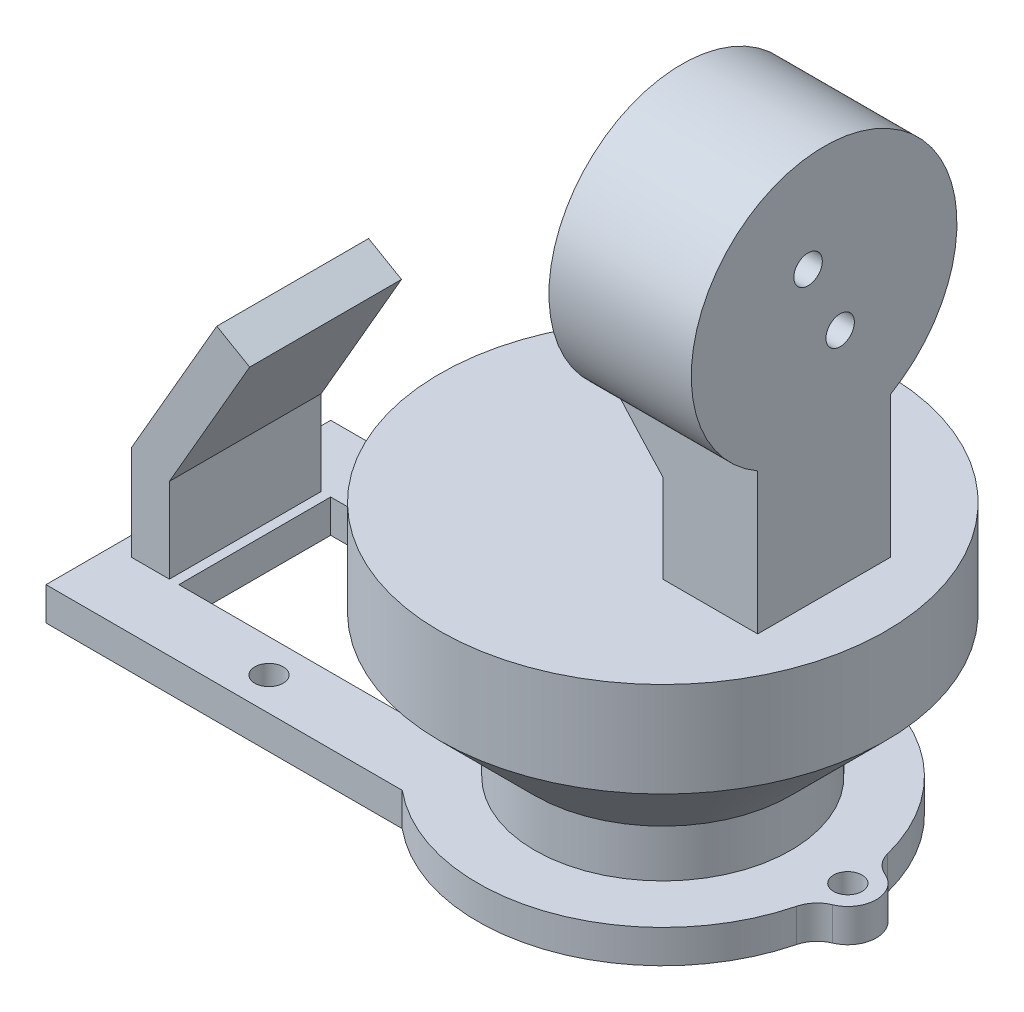
ISO-10303-21;
HEADER;
FILE_DESCRIPTION(('STEP AP214'),'2;1');
FILE_NAME('part.step','',(''),(''),'','','');
FILE_SCHEMA(('AUTOMOTIVE_DESIGN { 1 0 10303 214 1 1 1 1 }'));
ENDSEC;
DATA;
#1=APPLICATION_CONTEXT('core data for automotive mechanical design processes');
#2=APPLICATION_PROTOCOL_DEFINITION('international standard','automotive_design',2000,#1);
#3=PRODUCT_CONTEXT('',#1,'mechanical');
#4=PRODUCT('Part','Part','',(#3));
#5=PRODUCT_RELATED_PRODUCT_CATEGORY('part','',(#4));
#6=PRODUCT_DEFINITION_FORMATION('','',#4);
#7=PRODUCT_DEFINITION_CONTEXT('part definition',#1,'design');
#8=PRODUCT_DEFINITION('design','',#6,#7);
#9=PRODUCT_DEFINITION_SHAPE('','',#8);
#10=(LENGTH_UNIT() NAMED_UNIT(*) SI_UNIT(.MILLI.,.METRE.));
#11=(NAMED_UNIT(*) PLANE_ANGLE_UNIT() SI_UNIT($,.RADIAN.));
#12=(NAMED_UNIT(*) SI_UNIT($,.STERADIAN.) SOLID_ANGLE_UNIT());
#13=UNCERTAINTY_MEASURE_WITH_UNIT(LENGTH_MEASURE(1.E-05),#10,'distance_accuracy_value','');
#14=(GEOMETRIC_REPRESENTATION_CONTEXT(3) GLOBAL_UNCERTAINTY_ASSIGNED_CONTEXT((#13)) GLOBAL_UNIT_ASSIGNED_CONTEXT((#10,
#11,#12)) REPRESENTATION_CONTEXT('',''));
#15=CARTESIAN_POINT('',(0.,0.,0.));
#16=DIRECTION('',(0.,0.,1.));
#17=DIRECTION('',(1.,0.,0.));
#18=AXIS2_PLACEMENT_3D('',#15,#16,#17);
#19=CARTESIAN_POINT('',(0.,28.5,0.));
#20=DIRECTION('',(0.,1.,0.));
#21=DIRECTION('',(0.,0.,1.));
#22=AXIS2_PLACEMENT_3D('',#19,#20,#21);
#23=PLANE('',#22);
#24=CARTESIAN_POINT('',(0.,28.5,0.));
#25=DIRECTION('',(0.,1.,0.));
#26=DIRECTION('',(0.,0.,1.));
#27=AXIS2_PLACEMENT_3D('',#24,#25,#26);
#28=CIRCLE('',#27,23.5);
#29=CARTESIAN_POINT('',(0.,28.5,23.5));
#30=VERTEX_POINT('',#29);
#31=EDGE_CURVE('E229',#30,#30,#28,.T.);
#32=ORIENTED_EDGE('',*,*,#31,.T.);
#33=EDGE_LOOP('',(#32));
#34=FACE_BOUND('',#33,.T.);
#35=DIRECTION('',(-1.,0.,0.));
#36=VECTOR('',#35,1.);
#37=CARTESIAN_POINT('',(7.,28.5,-7.));
#38=LINE('',#37,#36);
#39=CARTESIAN_POINT('',(17.,28.5,-7.));
#40=VERTEX_POINT('',#39);
#41=CARTESIAN_POINT('',(7.,28.5,-7.));
#42=VERTEX_POINT('',#41);
#43=EDGE_CURVE('E202',#40,#42,#38,.T.);
#44=ORIENTED_EDGE('',*,*,#43,.F.);
#45=DIRECTION('',(0.,0.,-1.));
#46=VECTOR('',#45,1.);
#47=CARTESIAN_POINT('',(17.,28.5,7.));
#48=LINE('',#47,#46);
#49=CARTESIAN_POINT('',(17.,28.5,7.));
#50=VERTEX_POINT('',#49);
#51=EDGE_CURVE('E210',#50,#40,#48,.T.);
#52=ORIENTED_EDGE('',*,*,#51,.F.);
#53=DIRECTION('',(1.,0.,0.));
#54=VECTOR('',#53,1.);
#55=CARTESIAN_POINT('',(7.,28.5,7.));
#56=LINE('',#55,#54);
#57=CARTESIAN_POINT('',(7.,28.5,7.));
#58=VERTEX_POINT('',#57);
#59=EDGE_CURVE('E220',#58,#50,#56,.T.);
#60=ORIENTED_EDGE('',*,*,#59,.F.);
#61=DIRECTION('',(0.,0.,1.));
#62=VECTOR('',#61,1.);
#63=CARTESIAN_POINT('',(7.,28.5,7.));
#64=LINE('',#63,#62);
#65=EDGE_CURVE('E218',#42,#58,#64,.T.);
#66=ORIENTED_EDGE('',*,*,#65,.F.);
#67=EDGE_LOOP('',(#44,#52,#60,#66));
#68=FACE_BOUND('',#67,.T.);
#69=ADVANCED_FACE('F36',(#34,#68),#23,.T.);
#70=CARTESIAN_POINT('',(0.,3.5,0.));
#71=DIRECTION('',(0.,1.,0.));
#72=DIRECTION('',(0.,0.,1.));
#73=AXIS2_PLACEMENT_3D('',#70,#71,#72);
#74=PLANE('',#73);
#75=CARTESIAN_POINT('',(0.,3.5,0.));
#76=DIRECTION('',(0.,1.,0.));
#77=DIRECTION('',(0.,0.,1.));
#78=AXIS2_PLACEMENT_3D('',#75,#76,#77);
#79=CIRCLE('',#78,13.5);
#80=CARTESIAN_POINT('',(0.,3.5,13.5));
#81=VERTEX_POINT('',#80);
#82=EDGE_CURVE('E232',#81,#81,#79,.T.);
#83=ORIENTED_EDGE('',*,*,#82,.F.);
#84=EDGE_LOOP('',(#83));
#85=FACE_BOUND('',#84,.T.);
#86=DIRECTION('',(-1.,0.,0.));
#87=VECTOR('',#86,1.);
#88=CARTESIAN_POINT('',(0.,3.5,-8.));
#89=LINE('',#88,#87);
#90=CARTESIAN_POINT('',(-17.7834192437787,3.5,-8.));
#91=VERTEX_POINT('',#90);
#92=CARTESIAN_POINT('',(-43.,3.5,-8.));
#93=VERTEX_POINT('',#92);
#94=EDGE_CURVE('E285',#91,#93,#89,.T.);
#95=ORIENTED_EDGE('',*,*,#94,.F.);
#96=CARTESIAN_POINT('',(0.,3.5,0.));
#97=DIRECTION('',(0.,1.,0.));
#98=DIRECTION('',(0.,0.,1.));
#99=AXIS2_PLACEMENT_3D('',#96,#97,#98);
#100=CIRCLE('',#99,19.5);
#101=CARTESIAN_POINT('',(-17.7834192437787,3.5,8.00000000000001));
#102=VERTEX_POINT('',#101);
#103=EDGE_CURVE('E288',#91,#102,#100,.T.);
#104=ORIENTED_EDGE('',*,*,#103,.T.);
#105=DIRECTION('',(1.,0.,0.));
#106=VECTOR('',#105,1.);
#107=CARTESIAN_POINT('',(0.,3.5,8.));
#108=LINE('',#107,#106);
#109=CARTESIAN_POINT('',(-43.,3.5,8.00000000000001));
#110=VERTEX_POINT('',#109);
#111=EDGE_CURVE('E291',#110,#102,#108,.T.);
#112=ORIENTED_EDGE('',*,*,#111,.F.);
#113=DIRECTION('',(0.,0.,1.));
#114=VECTOR('',#113,1.);
#115=CARTESIAN_POINT('',(-43.,3.5,0.));
#116=LINE('',#115,#114);
#117=EDGE_CURVE('E296',#93,#110,#116,.T.);
#118=ORIENTED_EDGE('',*,*,#117,.F.);
#119=EDGE_LOOP('',(#95,#104,#112,#118));
#120=FACE_BOUND('',#119,.T.);
#121=CARTESIAN_POINT('',(-30.,3.5,11.5));
#122=DIRECTION('',(0.,1.,0.));
#123=DIRECTION('',(0.,0.,1.));
#124=AXIS2_PLACEMENT_3D('',#121,#122,#123);
#125=CIRCLE('',#124,1.5);
#126=CARTESIAN_POINT('',(-30.,3.5,13.));
#127=VERTEX_POINT('',#126);
#128=EDGE_CURVE('E299',#127,#127,#125,.T.);
#129=ORIENTED_EDGE('',*,*,#128,.F.);
#130=EDGE_LOOP('',(#129));
#131=FACE_BOUND('',#130,.T.);
#132=CARTESIAN_POINT('',(-30.,3.5,-11.5));
#133=DIRECTION('',(0.,1.,0.));
#134=DIRECTION('',(0.,0.,1.));
#135=AXIS2_PLACEMENT_3D('',#132,#133,#134);
#136=CIRCLE('',#135,1.5);
#137=CARTESIAN_POINT('',(-30.,3.5,-9.99999999999999));
#138=VERTEX_POINT('',#137);
#139=EDGE_CURVE('E302',#138,#138,#136,.T.);
#140=ORIENTED_EDGE('',*,*,#139,.F.);
#141=EDGE_LOOP('',(#140));
#142=FACE_BOUND('',#141,.T.);
#143=CARTESIAN_POINT('',(18.9,3.5,-4.80000000000002));
#144=VERTEX_POINT('',#143);
#145=CARTESIAN_POINT('',(-12.4599357943771,3.5,-15.));
#146=VERTEX_POINT('',#145);
#147=EDGE_CURVE('E293',#144,#146,#100,.T.);
#148=ORIENTED_EDGE('',*,*,#147,.T.);
#149=DIRECTION('',(-1.,0.,0.));
#150=VECTOR('',#149,1.);
#151=CARTESIAN_POINT('',(0.,3.5,-15.));
#152=LINE('',#151,#150);
#153=CARTESIAN_POINT('',(-50.,3.5,-15.));
#154=VERTEX_POINT('',#153);
#155=EDGE_CURVE('E305',#146,#154,#152,.T.);
#156=ORIENTED_EDGE('',*,*,#155,.T.);
#157=DIRECTION('',(0.,0.,1.));
#158=VECTOR('',#157,1.);
#159=CARTESIAN_POINT('',(-50.,3.5,0.));
#160=LINE('',#159,#158);
#161=CARTESIAN_POINT('',(-50.,3.5,15.));
#162=VERTEX_POINT('',#161);
#163=EDGE_CURVE('E307',#154,#162,#160,.T.);
#164=ORIENTED_EDGE('',*,*,#163,.T.);
#165=DIRECTION('',(1.,0.,0.));
#166=VECTOR('',#165,1.);
#167=CARTESIAN_POINT('',(0.,3.5,15.));
#168=LINE('',#167,#166);
#169=CARTESIAN_POINT('',(-12.4599357943771,3.5,15.));
#170=VERTEX_POINT('',#169);
#171=EDGE_CURVE('E309',#162,#170,#168,.T.);
#172=ORIENTED_EDGE('',*,*,#171,.T.);
#173=CARTESIAN_POINT('',(18.9,3.5,4.80000000000001));
#174=VERTEX_POINT('',#173);
#175=EDGE_CURVE('E292',#170,#174,#100,.T.);
#176=ORIENTED_EDGE('',*,*,#175,.T.);
#177=CARTESIAN_POINT('',(21.8076923076923,3.5,5.53846153846155));
#178=DIRECTION('',(0.,1.,0.));
#179=DIRECTION('',(0.,0.,1.));
#180=AXIS2_PLACEMENT_3D('',#177,#178,#179);
#181=CIRCLE('',#180,3.);
#182=CARTESIAN_POINT('',(20.6538461538462,3.5,2.76923076923078));
#183=VERTEX_POINT('',#182);
#184=EDGE_CURVE('E311',#183,#174,#181,.T.);
#185=ORIENTED_EDGE('',*,*,#184,.F.);
#186=CARTESIAN_POINT('',(19.5,3.5,0.));
#187=DIRECTION('',(0.,1.,0.));
#188=DIRECTION('',(0.,0.,1.));
#189=AXIS2_PLACEMENT_3D('',#186,#187,#188);
#190=CIRCLE('',#189,3.00000000000001);
#191=CARTESIAN_POINT('',(20.6538461538462,3.5,-2.76923076923078));
#192=VERTEX_POINT('',#191);
#193=EDGE_CURVE('E314',#183,#192,#190,.T.);
#194=ORIENTED_EDGE('',*,*,#193,.T.);
#195=CARTESIAN_POINT('',(21.8076923076923,3.5,-5.53846153846156));
#196=DIRECTION('',(0.,1.,0.));
#197=DIRECTION('',(0.,0.,1.));
#198=AXIS2_PLACEMENT_3D('',#195,#196,#197);
#199=CIRCLE('',#198,3.);
#200=EDGE_CURVE('E316',#144,#192,#199,.T.);
#201=ORIENTED_EDGE('',*,*,#200,.F.);
#202=EDGE_LOOP('',(#148,#156,#164,#172,#176,#185,#194,#201));
#203=FACE_BOUND('',#202,.T.);
#204=CARTESIAN_POINT('',(19.5,3.5,0.));
#205=DIRECTION('',(0.,1.,0.));
#206=DIRECTION('',(0.,0.,1.));
#207=AXIS2_PLACEMENT_3D('',#204,#205,#206);
#208=CIRCLE('',#207,1.5);
#209=CARTESIAN_POINT('',(19.5,3.5,1.5));
#210=VERTEX_POINT('',#209);
#211=EDGE_CURVE('E319',#210,#210,#208,.T.);
#212=ORIENTED_EDGE('',*,*,#211,.F.);
#213=EDGE_LOOP('',(#212));
#214=FACE_BOUND('',#213,.T.);
#215=DIRECTION('',(0.,0.,-1.));
#216=VECTOR('',#215,1.);
#217=CARTESIAN_POINT('',(-44.,3.5,8.));
#218=LINE('',#217,#216);
#219=CARTESIAN_POINT('',(-44.,3.5,8.));
#220=VERTEX_POINT('',#219);
#221=CARTESIAN_POINT('',(-44.,3.5,-8.));
#222=VERTEX_POINT('',#221);
#223=EDGE_CURVE('E275',#220,#222,#218,.T.);
#224=ORIENTED_EDGE('',*,*,#223,.F.);
#225=DIRECTION('',(1.,0.,0.));
#226=VECTOR('',#225,1.);
#227=CARTESIAN_POINT('',(-48.,3.5,8.));
#228=LINE('',#227,#226);
#229=CARTESIAN_POINT('',(-48.,3.5,8.));
#230=VERTEX_POINT('',#229);
#231=EDGE_CURVE('E253',#230,#220,#228,.T.);
#232=ORIENTED_EDGE('',*,*,#231,.F.);
#233=DIRECTION('',(0.,0.,-1.));
#234=VECTOR('',#233,1.);
#235=CARTESIAN_POINT('',(-48.,3.5,8.));
#236=LINE('',#235,#234);
#237=CARTESIAN_POINT('',(-48.,3.5,-8.));
#238=VERTEX_POINT('',#237);
#239=EDGE_CURVE('E272',#230,#238,#236,.T.);
#240=ORIENTED_EDGE('',*,*,#239,.T.);
#241=DIRECTION('',(1.,0.,0.));
#242=VECTOR('',#241,1.);
#243=CARTESIAN_POINT('',(-48.,3.5,-8.));
#244=LINE('',#243,#242);
#245=EDGE_CURVE('E242',#238,#222,#244,.T.);
#246=ORIENTED_EDGE('',*,*,#245,.T.);
#247=EDGE_LOOP('',(#224,#232,#240,#246));
#248=FACE_BOUND('',#247,.T.);
#249=ADVANCED_FACE('F408',(#85,#120,#131,#142,#203,#214,#248),#74,.T.);
#250=CARTESIAN_POINT('',(0.,3.5,0.));
#251=DIRECTION('',(0.,-1.,0.));
#252=DIRECTION('',(0.,0.,-1.));
#253=AXIS2_PLACEMENT_3D('',#250,#251,#252);
#254=CYLINDRICAL_SURFACE('',#253,19.5);
#255=CARTESIAN_POINT('',(0.,0.,0.));
#256=DIRECTION('',(0.,1.,0.));
#257=DIRECTION('',(0.,0.,1.));
#258=AXIS2_PLACEMENT_3D('',#255,#256,#257);
#259=CIRCLE('',#258,19.5);
#260=CARTESIAN_POINT('',(18.9,0.,-4.80000000000002));
#261=VERTEX_POINT('',#260);
#262=CARTESIAN_POINT('',(-12.4599357943771,0.,-15.));
#263=VERTEX_POINT('',#262);
#264=EDGE_CURVE('E330',#261,#263,#259,.T.);
#265=ORIENTED_EDGE('',*,*,#264,.T.);
#266=DIRECTION('',(0.,-1.,0.));
#267=VECTOR('',#266,1.);
#268=CARTESIAN_POINT('',(-12.4599357943771,3.5,-15.));
#269=LINE('',#268,#267);
#270=EDGE_CURVE('E377',#146,#263,#269,.T.);
#271=ORIENTED_EDGE('',*,*,#270,.F.);
#272=ORIENTED_EDGE('',*,*,#147,.F.);
#273=DIRECTION('',(0.,-1.,0.));
#274=VECTOR('',#273,1.);
#275=CARTESIAN_POINT('',(18.9,3.5,-4.80000000000002));
#276=LINE('',#275,#274);
#277=EDGE_CURVE('E359',#144,#261,#276,.T.);
#278=ORIENTED_EDGE('',*,*,#277,.T.);
#279=EDGE_LOOP('',(#265,#271,#272,#278));
#280=FACE_BOUND('',#279,.T.);
#281=ADVANCED_FACE('F448',(#280),#254,.T.);
#282=CARTESIAN_POINT('',(0.,3.5,-15.));
#283=DIRECTION('',(0.,0.,1.));
#284=DIRECTION('',(1.,0.,0.));
#285=AXIS2_PLACEMENT_3D('',#282,#283,#284);
#286=PLANE('',#285);
#287=DIRECTION('',(-1.,0.,0.));
#288=VECTOR('',#287,1.);
#289=CARTESIAN_POINT('',(0.,0.,-15.));
#290=LINE('',#289,#288);
#291=CARTESIAN_POINT('',(-50.,0.,-15.));
#292=VERTEX_POINT('',#291);
#293=EDGE_CURVE('E342',#263,#292,#290,.T.);
#294=ORIENTED_EDGE('',*,*,#293,.T.);
#295=DIRECTION('',(0.,-1.,0.));
#296=VECTOR('',#295,1.);
#297=CARTESIAN_POINT('',(-50.,3.5,-15.));
#298=LINE('',#297,#296);
#299=EDGE_CURVE('E374',#154,#292,#298,.T.);
#300=ORIENTED_EDGE('',*,*,#299,.F.);
#301=ORIENTED_EDGE('',*,*,#155,.F.);
#302=ORIENTED_EDGE('',*,*,#270,.T.);
#303=EDGE_LOOP('',(#294,#300,#301,#302));
#304=FACE_BOUND('',#303,.T.);
#305=ADVANCED_FACE('F485',(#304),#286,.F.);
#306=CARTESIAN_POINT('',(-50.,3.5,0.));
#307=DIRECTION('',(1.,0.,0.));
#308=DIRECTION('',(0.,0.,-1.));
#309=AXIS2_PLACEMENT_3D('',#306,#307,#308);
#310=PLANE('',#309);
#311=DIRECTION('',(0.,0.,1.));
#312=VECTOR('',#311,1.);
#313=CARTESIAN_POINT('',(-50.,0.,0.));
#314=LINE('',#313,#312);
#315=CARTESIAN_POINT('',(-50.,0.,15.));
#316=VERTEX_POINT('',#315);
#317=EDGE_CURVE('E344',#292,#316,#314,.T.);
#318=ORIENTED_EDGE('',*,*,#317,.T.);
#319=DIRECTION('',(0.,-1.,0.));
#320=VECTOR('',#319,1.);
#321=CARTESIAN_POINT('',(-50.,3.5,15.));
#322=LINE('',#321,#320);
#323=EDGE_CURVE('E371',#162,#316,#322,.T.);
#324=ORIENTED_EDGE('',*,*,#323,.F.);
#325=ORIENTED_EDGE('',*,*,#163,.F.);
#326=ORIENTED_EDGE('',*,*,#299,.T.);
#327=EDGE_LOOP('',(#318,#324,#325,#326));
#328=FACE_BOUND('',#327,.T.);
#329=ADVANCED_FACE('F481',(#328),#310,.F.);
#330=CARTESIAN_POINT('',(0.,3.5,15.));
#331=DIRECTION('',(0.,0.,-1.));
#332=DIRECTION('',(-1.,0.,0.));
#333=AXIS2_PLACEMENT_3D('',#330,#331,#332);
#334=PLANE('',#333);
#335=DIRECTION('',(1.,0.,0.));
#336=VECTOR('',#335,1.);
#337=CARTESIAN_POINT('',(0.,0.,15.));
#338=LINE('',#337,#336);
#339=CARTESIAN_POINT('',(-12.4599357943771,0.,15.));
#340=VERTEX_POINT('',#339);
#341=EDGE_CURVE('E346',#316,#340,#338,.T.);
#342=ORIENTED_EDGE('',*,*,#341,.T.);
#343=DIRECTION('',(0.,-1.,0.));
#344=VECTOR('',#343,1.);
#345=CARTESIAN_POINT('',(-12.4599357943771,3.5,15.));
#346=LINE('',#345,#344);
#347=EDGE_CURVE('E368',#170,#340,#346,.T.);
#348=ORIENTED_EDGE('',*,*,#347,.F.);
#349=ORIENTED_EDGE('',*,*,#171,.F.);
#350=ORIENTED_EDGE('',*,*,#323,.T.);
#351=EDGE_LOOP('',(#342,#348,#349,#350));
#352=FACE_BOUND('',#351,.T.);
#353=ADVANCED_FACE('F476',(#352),#334,.F.);
#354=CARTESIAN_POINT('',(18.9,0.,4.80000000000001));
#355=VERTEX_POINT('',#354);
#356=EDGE_CURVE('E329',#340,#355,#259,.T.);
#357=ORIENTED_EDGE('',*,*,#356,.T.);
#358=DIRECTION('',(0.,-1.,0.));
#359=VECTOR('',#358,1.);
#360=CARTESIAN_POINT('',(18.9,3.5,4.80000000000001));
#361=LINE('',#360,#359);
#362=EDGE_CURVE('E366',#174,#355,#361,.T.);
#363=ORIENTED_EDGE('',*,*,#362,.F.);
#364=ORIENTED_EDGE('',*,*,#175,.F.);
#365=ORIENTED_EDGE('',*,*,#347,.T.);
#366=EDGE_LOOP('',(#357,#363,#364,#365));
#367=FACE_BOUND('',#366,.T.);
#368=ADVANCED_FACE('F472',(#367),#254,.T.);
#369=CARTESIAN_POINT('',(21.8076923076923,3.5,5.53846153846155));
#370=DIRECTION('',(0.,-1.,0.));
#371=DIRECTION('',(0.,0.,-1.));
#372=AXIS2_PLACEMENT_3D('',#369,#370,#371);
#373=CYLINDRICAL_SURFACE('',#372,3.);
#374=CARTESIAN_POINT('',(21.8076923076923,0.,5.53846153846155));
#375=DIRECTION('',(0.,1.,0.));
#376=DIRECTION('',(0.,0.,1.));
#377=AXIS2_PLACEMENT_3D('',#374,#375,#376);
#378=CIRCLE('',#377,3.);
#379=CARTESIAN_POINT('',(20.6538461538462,0.,2.76923076923078));
#380=VERTEX_POINT('',#379);
#381=EDGE_CURVE('E348',#380,#355,#378,.T.);
#382=ORIENTED_EDGE('',*,*,#381,.F.);
#383=DIRECTION('',(0.,-1.,0.));
#384=VECTOR('',#383,1.);
#385=CARTESIAN_POINT('',(20.6538461538462,3.5,2.76923076923078));
#386=LINE('',#385,#384);
#387=EDGE_CURVE('E364',#183,#380,#386,.T.);
#388=ORIENTED_EDGE('',*,*,#387,.F.);
#389=ORIENTED_EDGE('',*,*,#184,.T.);
#390=ORIENTED_EDGE('',*,*,#362,.T.);
#391=EDGE_LOOP('',(#382,#388,#389,#390));
#392=FACE_BOUND('',#391,.T.);
#393=ADVANCED_FACE('F468',(#392),#373,.F.);
#394=CARTESIAN_POINT('',(19.5,3.5,0.));
#395=DIRECTION('',(0.,-1.,0.));
#396=DIRECTION('',(0.,0.,-1.));
#397=AXIS2_PLACEMENT_3D('',#394,#395,#396);
#398=CYLINDRICAL_SURFACE('',#397,3.00000000000001);
#399=CARTESIAN_POINT('',(19.5,0.,0.));
#400=DIRECTION('',(0.,1.,0.));
#401=DIRECTION('',(0.,0.,1.));
#402=AXIS2_PLACEMENT_3D('',#399,#400,#401);
#403=CIRCLE('',#402,3.00000000000001);
#404=CARTESIAN_POINT('',(20.6538461538462,0.,-2.76923076923078));
#405=VERTEX_POINT('',#404);
#406=EDGE_CURVE('E351',#380,#405,#403,.T.);
#407=ORIENTED_EDGE('',*,*,#406,.T.);
#408=DIRECTION('',(0.,-1.,0.));
#409=VECTOR('',#408,1.);
#410=CARTESIAN_POINT('',(20.6538461538462,3.5,-2.76923076923078));
#411=LINE('',#410,#409);
#412=EDGE_CURVE('E361',#192,#405,#411,.T.);
#413=ORIENTED_EDGE('',*,*,#412,.F.);
#414=ORIENTED_EDGE('',*,*,#193,.F.);
#415=ORIENTED_EDGE('',*,*,#387,.T.);
#416=EDGE_LOOP('',(#407,#413,#414,#415));
#417=FACE_BOUND('',#416,.T.);
#418=ADVANCED_FACE('F464',(#417),#398,.T.);
#419=CARTESIAN_POINT('',(0.,3.5,-8.));
#420=DIRECTION('',(0.,0.,1.));
#421=DIRECTION('',(1.,0.,0.));
#422=AXIS2_PLACEMENT_3D('',#419,#420,#421);
#423=PLANE('',#422);
#424=DIRECTION('',(-1.,0.,0.));
#425=VECTOR('',#424,1.);
#426=CARTESIAN_POINT('',(0.,0.,-8.));
#427=LINE('',#426,#425);
#428=CARTESIAN_POINT('',(-17.7834192437787,0.,-8.));
#429=VERTEX_POINT('',#428);
#430=CARTESIAN_POINT('',(-43.,0.,-8.));
#431=VERTEX_POINT('',#430);
#432=EDGE_CURVE('E274',#429,#431,#427,.T.);
#433=ORIENTED_EDGE('',*,*,#432,.F.);
#434=DIRECTION('',(0.,-1.,0.));
#435=VECTOR('',#434,1.);
#436=CARTESIAN_POINT('',(-17.7834192437787,3.5,-8.));
#437=LINE('',#436,#435);
#438=EDGE_CURVE('E362',#91,#429,#437,.T.);
#439=ORIENTED_EDGE('',*,*,#438,.F.);
#440=ORIENTED_EDGE('',*,*,#94,.T.);
#441=DIRECTION('',(0.,-1.,0.));
#442=VECTOR('',#441,1.);
#443=CARTESIAN_POINT('',(-43.,3.5,-8.));
#444=LINE('',#443,#442);
#445=EDGE_CURVE('E322',#93,#431,#444,.T.);
#446=ORIENTED_EDGE('',*,*,#445,.T.);
#447=EDGE_LOOP('',(#433,#439,#440,#446));
#448=FACE_BOUND('',#447,.T.);
#449=ADVANCED_FACE('F467',(#448),#423,.T.);
#450=CARTESIAN_POINT('',(-17.7834192437787,0.,8.00000000000001));
#451=VERTEX_POINT('',#450);
#452=EDGE_CURVE('E325',#429,#451,#259,.T.);
#453=ORIENTED_EDGE('',*,*,#452,.T.);
#454=DIRECTION('',(0.,-1.,0.));
#455=VECTOR('',#454,1.);
#456=CARTESIAN_POINT('',(-17.7834192437787,3.5,8.00000000000001));
#457=LINE('',#456,#455);
#458=EDGE_CURVE('E383',#102,#451,#457,.T.);
#459=ORIENTED_EDGE('',*,*,#458,.F.);
#460=ORIENTED_EDGE('',*,*,#103,.F.);
#461=ORIENTED_EDGE('',*,*,#438,.T.);
#462=EDGE_LOOP('',(#453,#459,#460,#461));
#463=FACE_BOUND('',#462,.T.);
#464=ADVANCED_FACE('F478',(#463),#254,.T.);
#465=CARTESIAN_POINT('',(0.,3.5,8.));
#466=DIRECTION('',(0.,0.,-1.));
#467=DIRECTION('',(-1.,0.,0.));
#468=AXIS2_PLACEMENT_3D('',#465,#466,#467);
#469=PLANE('',#468);
#470=DIRECTION('',(1.,0.,0.));
#471=VECTOR('',#470,1.);
#472=CARTESIAN_POINT('',(0.,0.,8.));
#473=LINE('',#472,#471);
#474=CARTESIAN_POINT('',(-43.,0.,8.00000000000001));
#475=VERTEX_POINT('',#474);
#476=EDGE_CURVE('E328',#475,#451,#473,.T.);
#477=ORIENTED_EDGE('',*,*,#476,.F.);
#478=DIRECTION('',(0.,-1.,0.));
#479=VECTOR('',#478,1.);
#480=CARTESIAN_POINT('',(-43.,3.5,8.00000000000001));
#481=LINE('',#480,#479);
#482=EDGE_CURVE('E381',#110,#475,#481,.T.);
#483=ORIENTED_EDGE('',*,*,#482,.F.);
#484=ORIENTED_EDGE('',*,*,#111,.T.);
#485=ORIENTED_EDGE('',*,*,#458,.T.);
#486=EDGE_LOOP('',(#477,#483,#484,#485));
#487=FACE_BOUND('',#486,.T.);
#488=ADVANCED_FACE('F462',(#487),#469,.T.);
#489=CARTESIAN_POINT('',(21.8076923076923,3.5,-5.53846153846156));
#490=DIRECTION('',(0.,-1.,0.));
#491=DIRECTION('',(0.,0.,-1.));
#492=AXIS2_PLACEMENT_3D('',#489,#490,#491);
#493=CYLINDRICAL_SURFACE('',#492,3.);
#494=CARTESIAN_POINT('',(21.8076923076923,0.,-5.53846153846156));
#495=DIRECTION('',(0.,1.,0.));
#496=DIRECTION('',(0.,0.,1.));
#497=AXIS2_PLACEMENT_3D('',#494,#495,#496);
#498=CIRCLE('',#497,3.);
#499=EDGE_CURVE('E354',#261,#405,#498,.T.);
#500=ORIENTED_EDGE('',*,*,#499,.F.);
#501=ORIENTED_EDGE('',*,*,#277,.F.);
#502=ORIENTED_EDGE('',*,*,#200,.T.);
#503=ORIENTED_EDGE('',*,*,#412,.T.);
#504=EDGE_LOOP('',(#500,#501,#502,#503));
#505=FACE_BOUND('',#504,.T.);
#506=ADVANCED_FACE('F458',(#505),#493,.F.);
#507=CARTESIAN_POINT('',(-30.,3.5,-11.5));
#508=DIRECTION('',(0.,-1.,0.));
#509=DIRECTION('',(0.,0.,-1.));
#510=AXIS2_PLACEMENT_3D('',#507,#508,#509);
#511=CYLINDRICAL_SURFACE('',#510,1.5);
#512=ORIENTED_EDGE('',*,*,#139,.T.);
#513=EDGE_LOOP('',(#512));
#514=FACE_BOUND('',#513,.T.);
#515=CARTESIAN_POINT('',(-30.,0.,-11.5));
#516=DIRECTION('',(0.,1.,0.));
#517=DIRECTION('',(0.,0.,1.));
#518=AXIS2_PLACEMENT_3D('',#515,#516,#517);
#519=CIRCLE('',#518,1.5);
#520=CARTESIAN_POINT('',(-30.,0.,-9.99999999999999));
#521=VERTEX_POINT('',#520);
#522=EDGE_CURVE('E339',#521,#521,#519,.T.);
#523=ORIENTED_EDGE('',*,*,#522,.F.);
#524=EDGE_LOOP('',(#523));
#525=FACE_BOUND('',#524,.T.);
#526=ADVANCED_FACE('F461',(#514,#525),#511,.F.);
#527=CARTESIAN_POINT('',(-30.,3.5,11.5));
#528=DIRECTION('',(0.,-1.,0.));
#529=DIRECTION('',(0.,0.,-1.));
#530=AXIS2_PLACEMENT_3D('',#527,#528,#529);
#531=CYLINDRICAL_SURFACE('',#530,1.5);
#532=ORIENTED_EDGE('',*,*,#128,.T.);
#533=EDGE_LOOP('',(#532));
#534=FACE_BOUND('',#533,.T.);
#535=CARTESIAN_POINT('',(-30.,0.,11.5));
#536=DIRECTION('',(0.,1.,0.));
#537=DIRECTION('',(0.,0.,1.));
#538=AXIS2_PLACEMENT_3D('',#535,#536,#537);
#539=CIRCLE('',#538,1.5);
#540=CARTESIAN_POINT('',(-30.,0.,13.));
#541=VERTEX_POINT('',#540);
#542=EDGE_CURVE('E336',#541,#541,#539,.T.);
#543=ORIENTED_EDGE('',*,*,#542,.F.);
#544=EDGE_LOOP('',(#543));
#545=FACE_BOUND('',#544,.T.);
#546=ADVANCED_FACE('F492',(#534,#545),#531,.F.);
#547=CARTESIAN_POINT('',(-43.,3.5,0.));
#548=DIRECTION('',(1.,0.,0.));
#549=DIRECTION('',(0.,0.,-1.));
#550=AXIS2_PLACEMENT_3D('',#547,#548,#549);
#551=PLANE('',#550);
#552=DIRECTION('',(0.,0.,1.));
#553=VECTOR('',#552,1.);
#554=CARTESIAN_POINT('',(-43.,0.,0.));
#555=LINE('',#554,#553);
#556=EDGE_CURVE('E333',#431,#475,#555,.T.);
#557=ORIENTED_EDGE('',*,*,#556,.F.);
#558=ORIENTED_EDGE('',*,*,#445,.F.);
#559=ORIENTED_EDGE('',*,*,#117,.T.);
#560=ORIENTED_EDGE('',*,*,#482,.T.);
#561=EDGE_LOOP('',(#557,#558,#559,#560));
#562=FACE_BOUND('',#561,.T.);
#563=ADVANCED_FACE('F456',(#562),#551,.T.);
#564=CARTESIAN_POINT('',(19.5,3.5,0.));
#565=DIRECTION('',(0.,-1.,0.));
#566=DIRECTION('',(0.,0.,-1.));
#567=AXIS2_PLACEMENT_3D('',#564,#565,#566);
#568=CYLINDRICAL_SURFACE('',#567,1.5);
#569=ORIENTED_EDGE('',*,*,#211,.T.);
#570=EDGE_LOOP('',(#569));
#571=FACE_BOUND('',#570,.T.);
#572=CARTESIAN_POINT('',(19.5,0.,0.));
#573=DIRECTION('',(0.,1.,0.));
#574=DIRECTION('',(0.,0.,1.));
#575=AXIS2_PLACEMENT_3D('',#572,#573,#574);
#576=CIRCLE('',#575,1.5);
#577=CARTESIAN_POINT('',(19.5,0.,1.5));
#578=VERTEX_POINT('',#577);
#579=EDGE_CURVE('E289',#578,#578,#576,.T.);
#580=ORIENTED_EDGE('',*,*,#579,.F.);
#581=EDGE_LOOP('',(#580));
#582=FACE_BOUND('',#581,.T.);
#583=ADVANCED_FACE('F452',(#571,#582),#568,.F.);
#584=CARTESIAN_POINT('',(0.,0.,0.));
#585=DIRECTION('',(0.,1.,0.));
#586=DIRECTION('',(0.,0.,1.));
#587=AXIS2_PLACEMENT_3D('',#584,#585,#586);
#588=PLANE('',#587);
#589=ORIENTED_EDGE('',*,*,#432,.T.);
#590=ORIENTED_EDGE('',*,*,#556,.T.);
#591=ORIENTED_EDGE('',*,*,#476,.T.);
#592=ORIENTED_EDGE('',*,*,#452,.F.);
#593=EDGE_LOOP('',(#589,#590,#591,#592));
#594=FACE_BOUND('',#593,.T.);
#595=ORIENTED_EDGE('',*,*,#542,.T.);
#596=EDGE_LOOP('',(#595));
#597=FACE_BOUND('',#596,.T.);
#598=ORIENTED_EDGE('',*,*,#522,.T.);
#599=EDGE_LOOP('',(#598));
#600=FACE_BOUND('',#599,.T.);
#601=ORIENTED_EDGE('',*,*,#264,.F.);
#602=ORIENTED_EDGE('',*,*,#499,.T.);
#603=ORIENTED_EDGE('',*,*,#406,.F.);
#604=ORIENTED_EDGE('',*,*,#381,.T.);
#605=ORIENTED_EDGE('',*,*,#356,.F.);
#606=ORIENTED_EDGE('',*,*,#341,.F.);
#607=ORIENTED_EDGE('',*,*,#317,.F.);
#608=ORIENTED_EDGE('',*,*,#293,.F.);
#609=EDGE_LOOP('',(#601,#602,#603,#604,#605,#606,#607,#608));
#610=FACE_BOUND('',#609,.T.);
#611=ORIENTED_EDGE('',*,*,#579,.T.);
#612=EDGE_LOOP('',(#611));
#613=FACE_BOUND('',#612,.T.);
#614=ADVANCED_FACE('F444',(#594,#597,#600,#610,#613),#588,.F.);
#615=CARTESIAN_POINT('',(-48.,3.5,8.));
#616=DIRECTION('',(-1.,0.,0.));
#617=DIRECTION('',(0.,0.,1.));
#618=AXIS2_PLACEMENT_3D('',#615,#616,#617);
#619=PLANE('',#618);
#620=DIRECTION('',(0.,1.,0.));
#621=VECTOR('',#620,1.);
#622=CARTESIAN_POINT('',(-48.,3.5,-8.));
#623=LINE('',#622,#621);
#624=CARTESIAN_POINT('',(-48.,13.5,-8.));
#625=VERTEX_POINT('',#624);
#626=EDGE_CURVE('E237',#238,#625,#623,.T.);
#627=ORIENTED_EDGE('',*,*,#626,.F.);
#628=ORIENTED_EDGE('',*,*,#239,.F.);
#629=DIRECTION('',(0.,1.,0.));
#630=VECTOR('',#629,1.);
#631=CARTESIAN_POINT('',(-48.,3.5,8.));
#632=LINE('',#631,#630);
#633=CARTESIAN_POINT('',(-48.,13.5,8.));
#634=VERTEX_POINT('',#633);
#635=EDGE_CURVE('E238',#230,#634,#632,.T.);
#636=ORIENTED_EDGE('',*,*,#635,.T.);
#637=DIRECTION('',(0.,0.,-1.));
#638=VECTOR('',#637,1.);
#639=CARTESIAN_POINT('',(-48.,13.5,8.));
#640=LINE('',#639,#638);
#641=EDGE_CURVE('E256',#634,#625,#640,.T.);
#642=ORIENTED_EDGE('',*,*,#641,.T.);
#643=EDGE_LOOP('',(#627,#628,#636,#642));
#644=FACE_BOUND('',#643,.T.);
#645=ADVANCED_FACE('F430',(#644),#619,.T.);
#646=CARTESIAN_POINT('',(-44.,3.5,8.));
#647=DIRECTION('',(-1.,0.,0.));
#648=DIRECTION('',(0.,0.,1.));
#649=AXIS2_PLACEMENT_3D('',#646,#647,#648);
#650=PLANE('',#649);
#651=DIRECTION('',(0.,1.,0.));
#652=VECTOR('',#651,1.);
#653=CARTESIAN_POINT('',(-44.,3.5,-8.));
#654=LINE('',#653,#652);
#655=CARTESIAN_POINT('',(-44.,12.4282032302756,-8.));
#656=VERTEX_POINT('',#655);
#657=EDGE_CURVE('E268',#222,#656,#654,.T.);
#658=ORIENTED_EDGE('',*,*,#657,.T.);
#659=DIRECTION('',(0.,0.,-1.));
#660=VECTOR('',#659,1.);
#661=CARTESIAN_POINT('',(-44.,12.4282032302756,8.));
#662=LINE('',#661,#660);
#663=CARTESIAN_POINT('',(-44.,12.4282032302756,8.));
#664=VERTEX_POINT('',#663);
#665=EDGE_CURVE('E278',#664,#656,#662,.T.);
#666=ORIENTED_EDGE('',*,*,#665,.F.);
#667=DIRECTION('',(0.,1.,0.));
#668=VECTOR('',#667,1.);
#669=CARTESIAN_POINT('',(-44.,3.5,8.));
#670=LINE('',#669,#668);
#671=EDGE_CURVE('E251',#220,#664,#670,.T.);
#672=ORIENTED_EDGE('',*,*,#671,.F.);
#673=ORIENTED_EDGE('',*,*,#223,.T.);
#674=EDGE_LOOP('',(#658,#666,#672,#673));
#675=FACE_BOUND('',#674,.T.);
#676=ADVANCED_FACE('F426',(#675),#650,.F.);
#677=CARTESIAN_POINT('',(-35.5358983848623,27.08845726812,8.));
#678=DIRECTION('',(0.866025403784442,-0.499999999999995,0.));
#679=DIRECTION('',(0.499999999999995,0.866025403784442,0.));
#680=AXIS2_PLACEMENT_3D('',#677,#678,#679);
#681=PLANE('',#680);
#682=DIRECTION('',(-0.499999999999995,-0.866025403784442,0.));
#683=VECTOR('',#682,1.);
#684=CARTESIAN_POINT('',(-35.5358983848623,27.08845726812,-8.));
#685=LINE('',#684,#683);
#686=CARTESIAN_POINT('',(-35.5358983848623,27.08845726812,-8.));
#687=VERTEX_POINT('',#686);
#688=EDGE_CURVE('E265',#687,#656,#685,.T.);
#689=ORIENTED_EDGE('',*,*,#688,.F.);
#690=DIRECTION('',(0.,0.,-1.));
#691=VECTOR('',#690,1.);
#692=CARTESIAN_POINT('',(-35.5358983848623,27.08845726812,8.));
#693=LINE('',#692,#691);
#694=CARTESIAN_POINT('',(-35.5358983848623,27.08845726812,8.));
#695=VERTEX_POINT('',#694);
#696=EDGE_CURVE('E280',#695,#687,#693,.T.);
#697=ORIENTED_EDGE('',*,*,#696,.F.);
#698=DIRECTION('',(-0.499999999999995,-0.866025403784442,0.));
#699=VECTOR('',#698,1.);
#700=CARTESIAN_POINT('',(-35.5358983848623,27.08845726812,8.));
#701=LINE('',#700,#699);
#702=EDGE_CURVE('E248',#695,#664,#701,.T.);
#703=ORIENTED_EDGE('',*,*,#702,.T.);
#704=ORIENTED_EDGE('',*,*,#665,.T.);
#705=EDGE_LOOP('',(#689,#697,#703,#704));
#706=FACE_BOUND('',#705,.T.);
#707=ADVANCED_FACE('F429',(#706),#681,.T.);
#708=CARTESIAN_POINT('',(-39.0000000000001,29.08845726812,8.));
#709=DIRECTION('',(0.499999999999994,0.866025403784442,0.));
#710=DIRECTION('',(-0.866025403784442,0.499999999999994,0.));
#711=AXIS2_PLACEMENT_3D('',#708,#709,#710);
#712=PLANE('',#711);
#713=DIRECTION('',(0.866025403784442,-0.499999999999994,0.));
#714=VECTOR('',#713,1.);
#715=CARTESIAN_POINT('',(-39.0000000000001,29.08845726812,-8.));
#716=LINE('',#715,#714);
#717=CARTESIAN_POINT('',(-39.0000000000001,29.08845726812,-8.));
#718=VERTEX_POINT('',#717);
#719=EDGE_CURVE('E262',#718,#687,#716,.T.);
#720=ORIENTED_EDGE('',*,*,#719,.F.);
#721=DIRECTION('',(0.,0.,-1.));
#722=VECTOR('',#721,1.);
#723=CARTESIAN_POINT('',(-39.0000000000001,29.08845726812,8.));
#724=LINE('',#723,#722);
#725=CARTESIAN_POINT('',(-39.0000000000001,29.08845726812,8.));
#726=VERTEX_POINT('',#725);
#727=EDGE_CURVE('E282',#726,#718,#724,.T.);
#728=ORIENTED_EDGE('',*,*,#727,.F.);
#729=DIRECTION('',(0.866025403784442,-0.499999999999994,0.));
#730=VECTOR('',#729,1.);
#731=CARTESIAN_POINT('',(-39.0000000000001,29.08845726812,8.));
#732=LINE('',#731,#730);
#733=EDGE_CURVE('E245',#726,#695,#732,.T.);
#734=ORIENTED_EDGE('',*,*,#733,.T.);
#735=ORIENTED_EDGE('',*,*,#696,.T.);
#736=EDGE_LOOP('',(#720,#728,#734,#735));
#737=FACE_BOUND('',#736,.T.);
#738=ADVANCED_FACE('F434',(#737),#712,.T.);
#739=CARTESIAN_POINT('',(-48.,13.5,8.));
#740=DIRECTION('',(-0.866025403784442,0.499999999999994,0.));
#741=DIRECTION('',(-0.499999999999994,-0.866025403784442,0.));
#742=AXIS2_PLACEMENT_3D('',#739,#740,#741);
#743=PLANE('',#742);
#744=DIRECTION('',(0.499999999999994,0.866025403784442,0.));
#745=VECTOR('',#744,1.);
#746=CARTESIAN_POINT('',(-48.,13.5,-8.));
#747=LINE('',#746,#745);
#748=EDGE_CURVE('E259',#625,#718,#747,.T.);
#749=ORIENTED_EDGE('',*,*,#748,.F.);
#750=ORIENTED_EDGE('',*,*,#641,.F.);
#751=DIRECTION('',(0.499999999999994,0.866025403784442,0.));
#752=VECTOR('',#751,1.);
#753=CARTESIAN_POINT('',(-48.,13.5,8.));
#754=LINE('',#753,#752);
#755=EDGE_CURVE('E241',#634,#726,#754,.T.);
#756=ORIENTED_EDGE('',*,*,#755,.T.);
#757=ORIENTED_EDGE('',*,*,#727,.T.);
#758=EDGE_LOOP('',(#749,#750,#756,#757));
#759=FACE_BOUND('',#758,.T.);
#760=ADVANCED_FACE('F421',(#759),#743,.T.);
#761=CARTESIAN_POINT('',(0.,0.,8.));
#762=DIRECTION('',(0.,0.,-1.));
#763=DIRECTION('',(-1.,0.,0.));
#764=AXIS2_PLACEMENT_3D('',#761,#762,#763);
#765=PLANE('',#764);
#766=ORIENTED_EDGE('',*,*,#635,.F.);
#767=ORIENTED_EDGE('',*,*,#231,.T.);
#768=ORIENTED_EDGE('',*,*,#671,.T.);
#769=ORIENTED_EDGE('',*,*,#702,.F.);
#770=ORIENTED_EDGE('',*,*,#733,.F.);
#771=ORIENTED_EDGE('',*,*,#755,.F.);
#772=EDGE_LOOP('',(#766,#767,#768,#769,#770,#771));
#773=FACE_BOUND('',#772,.T.);
#774=ADVANCED_FACE('F418',(#773),#765,.F.);
#775=CARTESIAN_POINT('',(0.,0.,-8.));
#776=DIRECTION('',(0.,0.,-1.));
#777=DIRECTION('',(-1.,0.,0.));
#778=AXIS2_PLACEMENT_3D('',#775,#776,#777);
#779=PLANE('',#778);
#780=ORIENTED_EDGE('',*,*,#626,.T.);
#781=ORIENTED_EDGE('',*,*,#748,.T.);
#782=ORIENTED_EDGE('',*,*,#719,.T.);
#783=ORIENTED_EDGE('',*,*,#688,.T.);
#784=ORIENTED_EDGE('',*,*,#657,.F.);
#785=ORIENTED_EDGE('',*,*,#245,.F.);
#786=EDGE_LOOP('',(#780,#781,#782,#783,#784,#785));
#787=FACE_BOUND('',#786,.T.);
#788=ADVANCED_FACE('F416',(#787),#779,.T.);
#789=CARTESIAN_POINT('',(0.,18.5,0.));
#790=DIRECTION('',(0.,-1.,0.));
#791=DIRECTION('',(0.,0.,-1.));
#792=AXIS2_PLACEMENT_3D('',#789,#790,#791);
#793=CYLINDRICAL_SURFACE('',#792,13.5);
#794=CARTESIAN_POINT('',(0.,8.50000000000001,0.));
#795=DIRECTION('',(0.,1.,0.));
#796=DIRECTION('',(0.,0.,1.));
#797=AXIS2_PLACEMENT_3D('',#794,#795,#796);
#798=CIRCLE('',#797,13.5);
#799=CARTESIAN_POINT('',(0.,8.50000000000001,13.5));
#800=VERTEX_POINT('',#799);
#801=EDGE_CURVE('E387',#800,#800,#798,.F.);
#802=ORIENTED_EDGE('',*,*,#801,.T.);
#803=EDGE_LOOP('',(#802));
#804=FACE_BOUND('',#803,.T.);
#805=ORIENTED_EDGE('',*,*,#82,.T.);
#806=EDGE_LOOP('',(#805));
#807=FACE_BOUND('',#806,.T.);
#808=ADVANCED_FACE('F412',(#804,#807),#793,.T.);
#809=CARTESIAN_POINT('',(0.,28.5,0.));
#810=DIRECTION('',(0.,-1.,0.));
#811=DIRECTION('',(0.,0.,-1.));
#812=AXIS2_PLACEMENT_3D('',#809,#810,#811);
#813=CYLINDRICAL_SURFACE('',#812,23.5);
#814=ORIENTED_EDGE('',*,*,#31,.F.);
#815=EDGE_LOOP('',(#814));
#816=FACE_BOUND('',#815,.T.);
#817=CARTESIAN_POINT('',(0.,18.5,0.));
#818=DIRECTION('',(0.,1.,0.));
#819=DIRECTION('',(0.,0.,1.));
#820=AXIS2_PLACEMENT_3D('',#817,#818,#819);
#821=CIRCLE('',#820,23.5);
#822=CARTESIAN_POINT('',(0.,18.5,23.5));
#823=VERTEX_POINT('',#822);
#824=EDGE_CURVE('E206',#823,#823,#821,.T.);
#825=ORIENTED_EDGE('',*,*,#824,.T.);
#826=EDGE_LOOP('',(#825));
#827=FACE_BOUND('',#826,.T.);
#828=ADVANCED_FACE('F404',(#816,#827),#813,.T.);
#829=CARTESIAN_POINT('',(17.,48.5,7.));
#830=DIRECTION('',(-1.,0.,0.));
#831=DIRECTION('',(0.,0.,1.));
#832=AXIS2_PLACEMENT_3D('',#829,#830,#831);
#833=PLANE('',#832);
#834=CARTESIAN_POINT('',(17.,59.1252311481466,1.69047304696279));
#835=DIRECTION('',(-1.,0.,0.));
#836=DIRECTION('',(0.,0.,1.));
#837=AXIS2_PLACEMENT_3D('',#834,#835,#836);
#838=CIRCLE('',#837,1.50000000000001);
#839=CARTESIAN_POINT('',(17.,59.1252311481466,3.1904730469628));
#840=VERTEX_POINT('',#839);
#841=EDGE_CURVE('E737',#840,#840,#838,.F.);
#842=ORIENTED_EDGE('',*,*,#841,.F.);
#843=EDGE_LOOP('',(#842));
#844=FACE_BOUND('',#843,.T.);
#845=CARTESIAN_POINT('',(17.,51.8747688518534,-1.69047304696279));
#846=DIRECTION('',(-1.,0.,0.));
#847=DIRECTION('',(0.,0.,1.));
#848=AXIS2_PLACEMENT_3D('',#845,#846,#847);
#849=CIRCLE('',#848,1.5);
#850=CARTESIAN_POINT('',(17.,51.8747688518534,-0.190473046962787));
#851=VERTEX_POINT('',#850);
#852=EDGE_CURVE('E742',#851,#851,#849,.F.);
#853=ORIENTED_EDGE('',*,*,#852,.F.);
#854=EDGE_LOOP('',(#853));
#855=FACE_BOUND('',#854,.T.);
#856=DIRECTION('',(0.,-1.,0.));
#857=VECTOR('',#856,1.);
#858=CARTESIAN_POINT('',(17.,48.5,-7.));
#859=LINE('',#858,#857);
#860=CARTESIAN_POINT('',(17.,43.3756443470179,-7.));
#861=VERTEX_POINT('',#860);
#862=EDGE_CURVE('E197',#861,#40,#859,.T.);
#863=ORIENTED_EDGE('',*,*,#862,.F.);
#864=CARTESIAN_POINT('',(17.,55.5,0.));
#865=DIRECTION('',(1.,0.,0.));
#866=DIRECTION('',(0.,0.,-1.));
#867=AXIS2_PLACEMENT_3D('',#864,#865,#866);
#868=CIRCLE('',#867,14.);
#869=CARTESIAN_POINT('',(17.,43.3756443470179,7.));
#870=VERTEX_POINT('',#869);
#871=EDGE_CURVE('E738',#861,#870,#868,.T.);
#872=ORIENTED_EDGE('',*,*,#871,.T.);
#873=DIRECTION('',(0.,-1.,0.));
#874=VECTOR('',#873,1.);
#875=CARTESIAN_POINT('',(17.,48.5,7.));
#876=LINE('',#875,#874);
#877=EDGE_CURVE('E212',#870,#50,#876,.T.);
#878=ORIENTED_EDGE('',*,*,#877,.T.);
#879=ORIENTED_EDGE('',*,*,#51,.T.);
#880=EDGE_LOOP('',(#863,#872,#878,#879));
#881=FACE_BOUND('',#880,.T.);
#882=ADVANCED_FACE('F211',(#844,#855,#881),#833,.F.);
#883=CARTESIAN_POINT('',(7.,48.5,-7.));
#884=DIRECTION('',(0.,0.,1.));
#885=DIRECTION('',(1.,0.,0.));
#886=AXIS2_PLACEMENT_3D('',#883,#884,#885);
#887=PLANE('',#886);
#888=DIRECTION('',(0.,-1.,0.));
#889=VECTOR('',#888,1.);
#890=CARTESIAN_POINT('',(7.,48.5,-7.));
#891=LINE('',#890,#889);
#892=CARTESIAN_POINT('',(7.,37.8364782673443,-7.));
#893=VERTEX_POINT('',#892);
#894=EDGE_CURVE('E207',#893,#42,#891,.T.);
#895=ORIENTED_EDGE('',*,*,#894,.F.);
#896=CARTESIAN_POINT('',(7.,37.8364782673443,-7.));
#897=CARTESIAN_POINT('',(6.78828865230114,38.064211003015,-7.));
#898=CARTESIAN_POINT('',(6.5768725569222,38.2922182755695,-7.));
#899=CARTESIAN_POINT('',(6.15470764648004,38.7488508779037,-7.));
#900=CARTESIAN_POINT('',(5.94395883333043,38.9774762094525,-7.));
#901=CARTESIAN_POINT('',(5.3128624323151,39.6643458356824,-7.));
#902=CARTESIAN_POINT('',(4.89363252187938,40.1236185256048,-7.));
#903=CARTESIAN_POINT('',(4.05896546144678,41.045630329726,-7.));
#904=CARTESIAN_POINT('',(3.64352843105455,41.5083695524064,-7.));
#905=CARTESIAN_POINT('',(3.0241050821658,42.2058239974984,-7.));
#906=CARTESIAN_POINT('',(2.81824509006891,42.4388751307968,-7.));
#907=CARTESIAN_POINT('',(2.40797946378838,42.9062578519656,-7.));
#908=CARTESIAN_POINT('',(2.20357384437838,43.1405894528005,-7.));
#909=CARTESIAN_POINT('',(2.00000000000002,43.3756443470179,-7.));
#910=B_SPLINE_CURVE_WITH_KNOTS('',3,(#896,#897,#898,#899,#900,#901,#902,#903,#904,#905,#906,
#907,#908,#909),.UNSPECIFIED.,.F.,.F.,(4,2,2,2,2,2,4),(0.,0.932820667905155,1.86564400850775,
3.73114820812002,5.59671103274029,6.5295617299659,7.46242188968107),.UNSPECIFIED.);
#911=CARTESIAN_POINT('',(2.,43.3756443470179,-7.));
#912=VERTEX_POINT('',#911);
#913=EDGE_CURVE('E51',#893,#912,#910,.T.);
#914=ORIENTED_EDGE('',*,*,#913,.T.);
#915=DIRECTION('',(1.,0.,0.));
#916=VECTOR('',#915,1.);
#917=CARTESIAN_POINT('',(2.,43.3756443470179,-7.));
#918=LINE('',#917,#916);
#919=EDGE_CURVE('E58',#912,#861,#918,.T.);
#920=ORIENTED_EDGE('',*,*,#919,.T.);
#921=ORIENTED_EDGE('',*,*,#862,.T.);
#922=ORIENTED_EDGE('',*,*,#43,.T.);
#923=EDGE_LOOP('',(#895,#914,#920,#921,#922));
#924=FACE_BOUND('',#923,.T.);
#925=ADVANCED_FACE('F200',(#924),#887,.F.);
#926=CARTESIAN_POINT('',(7.,48.5,7.));
#927=DIRECTION('',(1.,0.,0.));
#928=DIRECTION('',(0.,0.,-1.));
#929=AXIS2_PLACEMENT_3D('',#926,#927,#928);
#930=PLANE('',#929);
#931=DIRECTION('',(0.,-1.,0.));
#932=VECTOR('',#931,1.);
#933=CARTESIAN_POINT('',(7.,48.5,7.));
#934=LINE('',#933,#932);
#935=CARTESIAN_POINT('',(7.,37.8364782673443,7.));
#936=VERTEX_POINT('',#935);
#937=EDGE_CURVE('E226',#936,#58,#934,.T.);
#938=ORIENTED_EDGE('',*,*,#937,.F.);
#939=CARTESIAN_POINT('',(7.,55.5,0.));
#940=DIRECTION('',(1.,0.,0.));
#941=DIRECTION('',(0.,0.,-1.));
#942=AXIS2_PLACEMENT_3D('',#939,#940,#941);
#943=CIRCLE('',#942,19.);
#944=EDGE_CURVE('E390',#936,#893,#943,.T.);
#945=ORIENTED_EDGE('',*,*,#944,.T.);
#946=ORIENTED_EDGE('',*,*,#894,.T.);
#947=ORIENTED_EDGE('',*,*,#65,.T.);
#948=EDGE_LOOP('',(#938,#945,#946,#947));
#949=FACE_BOUND('',#948,.T.);
#950=ADVANCED_FACE('F401',(#949),#930,.F.);
#951=CARTESIAN_POINT('',(7.,48.5,7.));
#952=DIRECTION('',(0.,0.,-1.));
#953=DIRECTION('',(-1.,0.,0.));
#954=AXIS2_PLACEMENT_3D('',#951,#952,#953);
#955=PLANE('',#954);
#956=ORIENTED_EDGE('',*,*,#877,.F.);
#957=DIRECTION('',(1.,0.,0.));
#958=VECTOR('',#957,1.);
#959=CARTESIAN_POINT('',(2.,43.3756443470179,7.));
#960=LINE('',#959,#958);
#961=CARTESIAN_POINT('',(2.,43.3756443470179,7.));
#962=VERTEX_POINT('',#961);
#963=EDGE_CURVE('E65',#870,#962,#960,.F.);
#964=ORIENTED_EDGE('',*,*,#963,.T.);
#965=CARTESIAN_POINT('',(2.00000000000002,43.3756443470179,7.));
#966=CARTESIAN_POINT('',(2.20357384437838,43.1405894528005,7.));
#967=CARTESIAN_POINT('',(2.40797946378838,42.9062578519656,7.));
#968=CARTESIAN_POINT('',(2.81824509006891,42.4388751307968,7.));
#969=CARTESIAN_POINT('',(3.0241050821658,42.2058239974984,7.));
#970=CARTESIAN_POINT('',(3.64352843105454,41.5083695524064,7.));
#971=CARTESIAN_POINT('',(4.05896546144678,41.045630329726,7.));
#972=CARTESIAN_POINT('',(4.89363252187938,40.1236185256048,7.));
#973=CARTESIAN_POINT('',(5.3128624323151,39.6643458356824,7.));
#974=CARTESIAN_POINT('',(5.94395883333043,38.9774762094525,7.));
#975=CARTESIAN_POINT('',(6.15470764648004,38.7488508779037,7.));
#976=CARTESIAN_POINT('',(6.5768725569222,38.2922182755695,7.));
#977=CARTESIAN_POINT('',(6.78828865230114,38.064211003015,7.));
#978=CARTESIAN_POINT('',(7.,37.8364782673443,7.));
#979=B_SPLINE_CURVE_WITH_KNOTS('',3,(#965,#966,#967,#968,#969,#970,#971,#972,#973,#974,#975,
#976,#977,#978),.UNSPECIFIED.,.F.,.F.,(4,2,2,2,2,2,4),(0.,0.932860159715165,1.86571085694078,
3.73127368156105,5.59677788117332,6.52960122177592,7.46242188968107),.UNSPECIFIED.);
#980=EDGE_CURVE('E11',#962,#936,#979,.T.);
#981=ORIENTED_EDGE('',*,*,#980,.T.);
#982=ORIENTED_EDGE('',*,*,#937,.T.);
#983=ORIENTED_EDGE('',*,*,#59,.T.);
#984=EDGE_LOOP('',(#956,#964,#981,#982,#983));
#985=FACE_BOUND('',#984,.T.);
#986=ADVANCED_FACE('F685',(#985),#955,.F.);
#987=CARTESIAN_POINT('',(2.,55.5,0.));
#988=DIRECTION('',(1.,0.,0.));
#989=DIRECTION('',(0.,0.,-1.));
#990=AXIS2_PLACEMENT_3D('',#987,#988,#989);
#991=CYLINDRICAL_SURFACE('',#990,14.);
#992=ORIENTED_EDGE('',*,*,#919,.F.);
#993=CARTESIAN_POINT('',(2.,55.5,0.));
#994=DIRECTION('',(1.,0.,0.));
#995=DIRECTION('',(0.,0.,-1.));
#996=AXIS2_PLACEMENT_3D('',#993,#994,#995);
#997=CIRCLE('',#996,14.);
#998=EDGE_CURVE('E740',#912,#962,#997,.T.);
#999=ORIENTED_EDGE('',*,*,#998,.T.);
#1000=ORIENTED_EDGE('',*,*,#963,.F.);
#1001=ORIENTED_EDGE('',*,*,#871,.F.);
#1002=EDGE_LOOP('',(#992,#999,#1000,#1001));
#1003=FACE_BOUND('',#1002,.T.);
#1004=ADVANCED_FACE('F520',(#1003),#991,.T.);
#1005=CARTESIAN_POINT('',(2.,55.5,0.));
#1006=DIRECTION('',(1.,0.,0.));
#1007=DIRECTION('',(0.,0.,-1.));
#1008=AXIS2_PLACEMENT_3D('',#1005,#1006,#1007);
#1009=PLANE('',#1008);
#1010=CARTESIAN_POINT('',(2.,59.1252311481466,1.69047304696279));
#1011=DIRECTION('',(-1.,0.,0.));
#1012=DIRECTION('',(0.,0.,1.));
#1013=AXIS2_PLACEMENT_3D('',#1010,#1011,#1012);
#1014=CIRCLE('',#1013,1.50000000000001);
#1015=CARTESIAN_POINT('',(2.,59.1252311481466,3.1904730469628));
#1016=VERTEX_POINT('',#1015);
#1017=EDGE_CURVE('E734',#1016,#1016,#1014,.T.);
#1018=ORIENTED_EDGE('',*,*,#1017,.F.);
#1019=EDGE_LOOP('',(#1018));
#1020=FACE_BOUND('',#1019,.T.);
#1021=CARTESIAN_POINT('',(2.,51.8747688518534,-1.69047304696279));
#1022=DIRECTION('',(-1.,0.,0.));
#1023=DIRECTION('',(0.,0.,1.));
#1024=AXIS2_PLACEMENT_3D('',#1021,#1022,#1023);
#1025=CIRCLE('',#1024,1.5);
#1026=CARTESIAN_POINT('',(2.,51.8747688518534,-0.190473046962787));
#1027=VERTEX_POINT('',#1026);
#1028=EDGE_CURVE('E745',#1027,#1027,#1025,.T.);
#1029=ORIENTED_EDGE('',*,*,#1028,.F.);
#1030=EDGE_LOOP('',(#1029));
#1031=FACE_BOUND('',#1030,.T.);
#1032=EDGE_CURVE('E750',#962,#912,#997,.T.);
#1033=ORIENTED_EDGE('',*,*,#1032,.F.);
#1034=ORIENTED_EDGE('',*,*,#998,.F.);
#1035=EDGE_LOOP('',(#1033,#1034));
#1036=FACE_BOUND('',#1035,.T.);
#1037=ADVANCED_FACE('F511',(#1020,#1031,#1036),#1009,.F.);
#1038=CARTESIAN_POINT('',(0.,18.5,0.));
#1039=DIRECTION('',(0.,1.,0.));
#1040=DIRECTION('',(0.,0.,1.));
#1041=AXIS2_PLACEMENT_3D('',#1038,#1039,#1040);
#1042=CONICAL_SURFACE('',#1041,23.5000000000001,0.785398163397454);
#1043=ORIENTED_EDGE('',*,*,#801,.F.);
#1044=EDGE_LOOP('',(#1043));
#1045=FACE_BOUND('',#1044,.T.);
#1046=ORIENTED_EDGE('',*,*,#824,.F.);
#1047=EDGE_LOOP('',(#1046));
#1048=FACE_BOUND('',#1047,.T.);
#1049=ADVANCED_FACE('F506',(#1045,#1048),#1042,.T.);
#1050=CARTESIAN_POINT('',(23.501,51.8747688518534,-1.69047304696279));
#1051=DIRECTION('',(-1.,0.,0.));
#1052=DIRECTION('',(0.,0.,1.));
#1053=AXIS2_PLACEMENT_3D('',#1050,#1051,#1052);
#1054=CYLINDRICAL_SURFACE('',#1053,1.5);
#1055=ORIENTED_EDGE('',*,*,#1028,.T.);
#1056=EDGE_LOOP('',(#1055));
#1057=FACE_BOUND('',#1056,.T.);
#1058=ORIENTED_EDGE('',*,*,#852,.T.);
#1059=EDGE_LOOP('',(#1058));
#1060=FACE_BOUND('',#1059,.T.);
#1061=ADVANCED_FACE('F510',(#1057,#1060),#1054,.F.);
#1062=CARTESIAN_POINT('',(23.501,59.1252311481466,1.69047304696279));
#1063=DIRECTION('',(-1.,0.,0.));
#1064=DIRECTION('',(0.,0.,1.));
#1065=AXIS2_PLACEMENT_3D('',#1062,#1063,#1064);
#1066=CYLINDRICAL_SURFACE('',#1065,1.50000000000001);
#1067=ORIENTED_EDGE('',*,*,#1017,.T.);
#1068=EDGE_LOOP('',(#1067));
#1069=FACE_BOUND('',#1068,.T.);
#1070=ORIENTED_EDGE('',*,*,#841,.T.);
#1071=EDGE_LOOP('',(#1070));
#1072=FACE_BOUND('',#1071,.T.);
#1073=ADVANCED_FACE('F517',(#1069,#1072),#1066,.F.);
#1074=CARTESIAN_POINT('',(7.,55.5,0.));
#1075=DIRECTION('',(1.,0.,0.));
#1076=DIRECTION('',(0.,0.,-1.));
#1077=AXIS2_PLACEMENT_3D('',#1074,#1075,#1076);
#1078=CONICAL_SURFACE('',#1077,19.,0.785398163397453);
#1079=ORIENTED_EDGE('',*,*,#980,.F.);
#1080=ORIENTED_EDGE('',*,*,#1032,.T.);
#1081=ORIENTED_EDGE('',*,*,#913,.F.);
#1082=ORIENTED_EDGE('',*,*,#944,.F.);
#1083=EDGE_LOOP('',(#1079,#1080,#1081,#1082));
#1084=FACE_BOUND('',#1083,.T.);
#1085=ADVANCED_FACE('F39',(#1084),#1078,.T.);
#1086=CLOSED_SHELL('',(#69,#249,#281,#305,#329,#353,#368,#393,#418,#449,#464,#488,#506,#526,
#546,#563,#583,#614,#645,#676,#707,#738,#760,#774,#788,#808,#828,#882,#925,#950,#986,#1004,
#1037,#1049,#1061,#1073,#1085));
#1087=MANIFOLD_SOLID_BREP('B2',#1086);
#1088=ADVANCED_BREP_SHAPE_REPRESENTATION('',(#18,#1087),#14);
#1089=SHAPE_DEFINITION_REPRESENTATION(#9,#1088);
ENDSEC;
END-ISO-10303-21;
